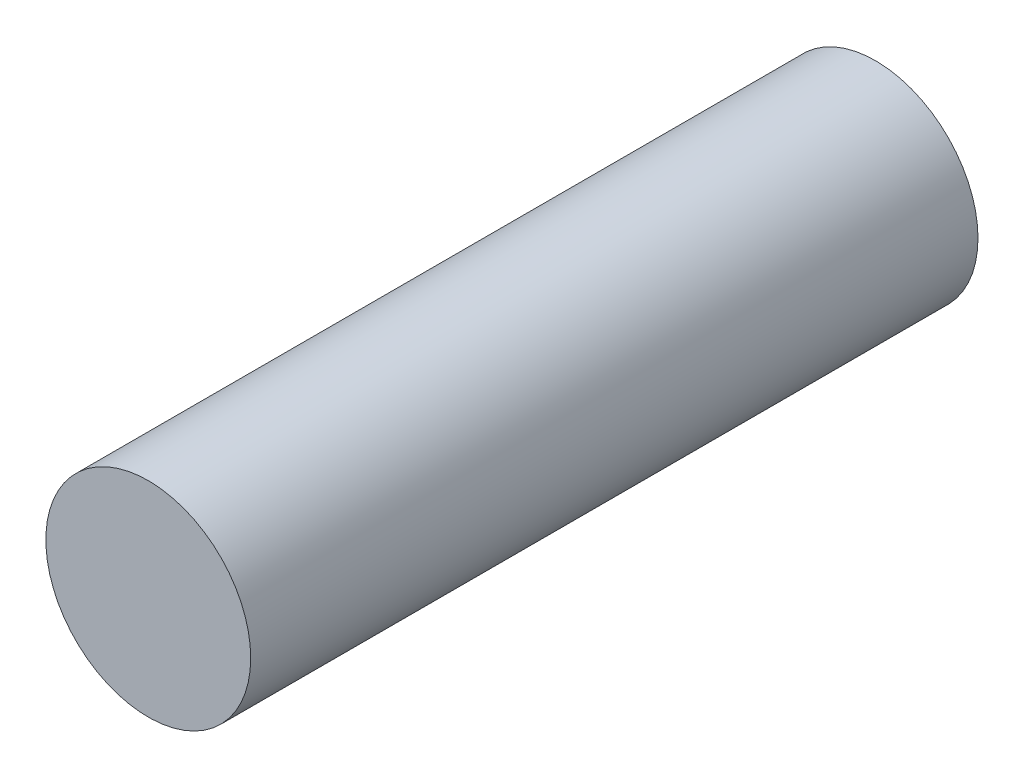
ISO-10303-21;
HEADER;
FILE_DESCRIPTION(('STEP AP214'),'2;1');
FILE_NAME('part.step','',(''),(''),'','','');
FILE_SCHEMA(('AUTOMOTIVE_DESIGN { 1 0 10303 214 1 1 1 1 }'));
ENDSEC;
DATA;
#1=APPLICATION_CONTEXT('core data for automotive mechanical design processes');
#2=APPLICATION_PROTOCOL_DEFINITION('international standard','automotive_design',2000,#1);
#3=PRODUCT_CONTEXT('',#1,'mechanical');
#4=PRODUCT('Part','Part','',(#3));
#5=PRODUCT_RELATED_PRODUCT_CATEGORY('part','',(#4));
#6=PRODUCT_DEFINITION_FORMATION('','',#4);
#7=PRODUCT_DEFINITION_CONTEXT('part definition',#1,'design');
#8=PRODUCT_DEFINITION('design','',#6,#7);
#9=PRODUCT_DEFINITION_SHAPE('','',#8);
#10=(LENGTH_UNIT() NAMED_UNIT(*) SI_UNIT(.MILLI.,.METRE.));
#11=(NAMED_UNIT(*) PLANE_ANGLE_UNIT() SI_UNIT($,.RADIAN.));
#12=(NAMED_UNIT(*) SI_UNIT($,.STERADIAN.) SOLID_ANGLE_UNIT());
#13=UNCERTAINTY_MEASURE_WITH_UNIT(LENGTH_MEASURE(1.E-05),#10,'distance_accuracy_value','');
#14=(GEOMETRIC_REPRESENTATION_CONTEXT(3) GLOBAL_UNCERTAINTY_ASSIGNED_CONTEXT((#13)) GLOBAL_UNIT_ASSIGNED_CONTEXT((#10,
#11,#12)) REPRESENTATION_CONTEXT('',''));
#15=CARTESIAN_POINT('',(0.,0.,0.));
#16=DIRECTION('',(0.,0.,1.));
#17=DIRECTION('',(1.,0.,0.));
#18=AXIS2_PLACEMENT_3D('',#15,#16,#17);
#19=CARTESIAN_POINT('',(0.,0.,-142.));
#20=DIRECTION('',(0.,0.,1.));
#21=DIRECTION('',(1.,0.,0.));
#22=AXIS2_PLACEMENT_3D('',#19,#20,#21);
#23=CYLINDRICAL_SURFACE('',#22,19.9999999999997);
#24=CARTESIAN_POINT('',(0.,0.,-142.));
#25=DIRECTION('',(0.,0.,1.));
#26=DIRECTION('',(1.,0.,0.));
#27=AXIS2_PLACEMENT_3D('',#24,#25,#26);
#28=CIRCLE('',#27,19.9999999999997);
#29=CARTESIAN_POINT('',(19.9999999999997,0.,-142.));
#30=VERTEX_POINT('',#29);
#31=EDGE_CURVE('E10',#30,#30,#28,.T.);
#32=ORIENTED_EDGE('',*,*,#31,.T.);
#33=EDGE_LOOP('',(#32));
#34=FACE_BOUND('',#33,.T.);
#35=CARTESIAN_POINT('',(0.,0.,0.));
#36=DIRECTION('',(0.,0.,1.));
#37=DIRECTION('',(1.,0.,0.));
#38=AXIS2_PLACEMENT_3D('',#35,#36,#37);
#39=CIRCLE('',#38,19.9999999999997);
#40=CARTESIAN_POINT('',(19.9999999999997,0.,0.));
#41=VERTEX_POINT('',#40);
#42=EDGE_CURVE('E35',#41,#41,#39,.T.);
#43=ORIENTED_EDGE('',*,*,#42,.F.);
#44=EDGE_LOOP('',(#43));
#45=FACE_BOUND('',#44,.T.);
#46=ADVANCED_FACE('F32',(#34,#45),#23,.T.);
#47=CARTESIAN_POINT('',(0.,0.,-142.));
#48=DIRECTION('',(0.,0.,1.));
#49=DIRECTION('',(1.,0.,0.));
#50=AXIS2_PLACEMENT_3D('',#47,#48,#49);
#51=PLANE('',#50);
#52=ORIENTED_EDGE('',*,*,#31,.F.);
#53=EDGE_LOOP('',(#52));
#54=FACE_BOUND('',#53,.T.);
#55=ADVANCED_FACE('F47',(#54),#51,.F.);
#56=CARTESIAN_POINT('',(0.,0.,0.));
#57=DIRECTION('',(0.,0.,1.));
#58=DIRECTION('',(1.,0.,0.));
#59=AXIS2_PLACEMENT_3D('',#56,#57,#58);
#60=PLANE('',#59);
#61=ORIENTED_EDGE('',*,*,#42,.T.);
#62=EDGE_LOOP('',(#61));
#63=FACE_BOUND('',#62,.T.);
#64=ADVANCED_FACE('F44',(#63),#60,.T.);
#65=CLOSED_SHELL('',(#46,#55,#64));
#66=MANIFOLD_SOLID_BREP('B2',#65);
#67=ADVANCED_BREP_SHAPE_REPRESENTATION('',(#18,#66),#14);
#68=SHAPE_DEFINITION_REPRESENTATION(#9,#67);
ENDSEC;
END-ISO-10303-21;
